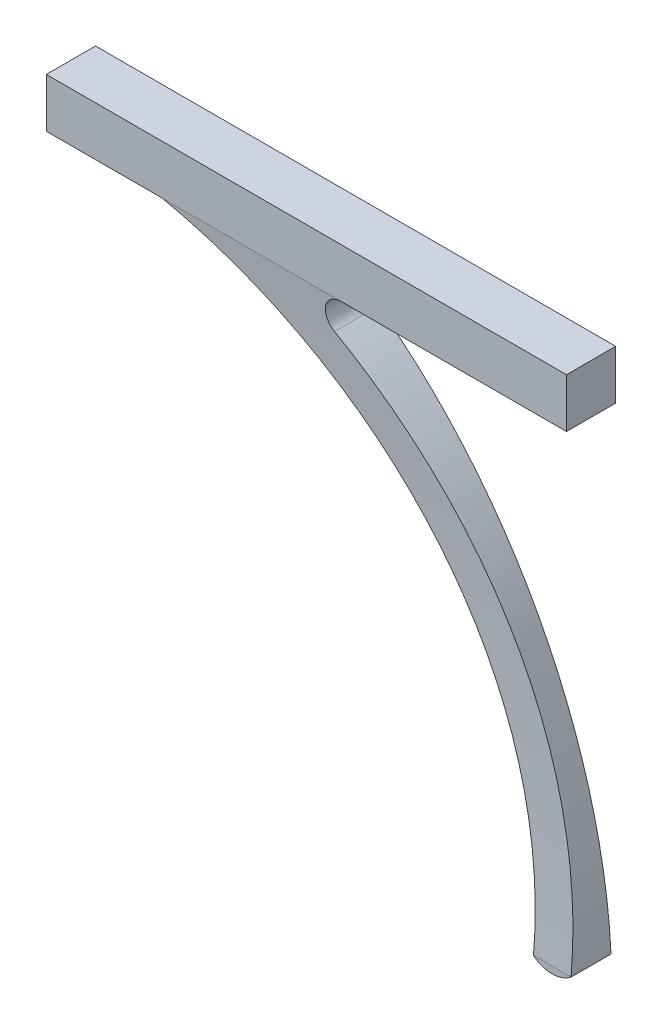
ISO-10303-21;
HEADER;
FILE_DESCRIPTION(('STEP AP214'),'2;1');
FILE_NAME('part.step','',(''),(''),'','','');
FILE_SCHEMA(('AUTOMOTIVE_DESIGN { 1 0 10303 214 1 1 1 1 }'));
ENDSEC;
DATA;
#1=APPLICATION_CONTEXT('core data for automotive mechanical design processes');
#2=APPLICATION_PROTOCOL_DEFINITION('international standard','automotive_design',2000,#1);
#3=PRODUCT_CONTEXT('',#1,'mechanical');
#4=PRODUCT('Part','Part','',(#3));
#5=PRODUCT_RELATED_PRODUCT_CATEGORY('part','',(#4));
#6=PRODUCT_DEFINITION_FORMATION('','',#4);
#7=PRODUCT_DEFINITION_CONTEXT('part definition',#1,'design');
#8=PRODUCT_DEFINITION('design','',#6,#7);
#9=PRODUCT_DEFINITION_SHAPE('','',#8);
#10=(LENGTH_UNIT() NAMED_UNIT(*) SI_UNIT(.MILLI.,.METRE.));
#11=(NAMED_UNIT(*) PLANE_ANGLE_UNIT() SI_UNIT($,.RADIAN.));
#12=(NAMED_UNIT(*) SI_UNIT($,.STERADIAN.) SOLID_ANGLE_UNIT());
#13=UNCERTAINTY_MEASURE_WITH_UNIT(LENGTH_MEASURE(1.E-05),#10,'distance_accuracy_value','');
#14=(GEOMETRIC_REPRESENTATION_CONTEXT(3) GLOBAL_UNCERTAINTY_ASSIGNED_CONTEXT((#13)) GLOBAL_UNIT_ASSIGNED_CONTEXT((#10,
#11,#12)) REPRESENTATION_CONTEXT('',''));
#15=CARTESIAN_POINT('',(0.,0.,0.));
#16=DIRECTION('',(0.,0.,1.));
#17=DIRECTION('',(1.,0.,0.));
#18=AXIS2_PLACEMENT_3D('',#15,#16,#17);
#19=CARTESIAN_POINT('',(-313.249254210473,43.7591889450389,8.5));
#20=DIRECTION('',(0.,0.,-1.));
#21=DIRECTION('',(-1.,0.,0.));
#22=AXIS2_PLACEMENT_3D('',#19,#20,#21);
#23=CYLINDRICAL_SURFACE('',#22,82.1861128246696);
#24=CARTESIAN_POINT('',(-294.419566448077,123.759188945039,8.5));
#25=CARTESIAN_POINT('',(-293.669472059671,123.582638201541,8.48435873597125));
#26=CARTESIAN_POINT('',(-292.921918514753,123.395551162552,8.46787217964508));
#27=CARTESIAN_POINT('',(-291.432403549191,123.00044038415,8.43329331302592));
#28=CARTESIAN_POINT('',(-290.690442120292,122.792416675651,8.4152010051039));
#29=CARTESIAN_POINT('',(-288.473957564391,122.137217220973,8.35864898485102));
#30=CARTESIAN_POINT('',(-287.008580838007,121.658853507064,8.31790884335726));
#31=CARTESIAN_POINT('',(-284.107290914414,120.620605151221,8.23116940272998));
#32=CARTESIAN_POINT('',(-282.671377060351,120.060722328958,8.18517022099383));
#33=CARTESIAN_POINT('',(-279.833890523642,118.861399545579,8.08885754144365));
#34=CARTESIAN_POINT('',(-278.432305863342,118.221987819824,8.03854557676907));
#35=CARTESIAN_POINT('',(-275.667384018503,116.865491304418,7.93462638026038));
#36=CARTESIAN_POINT('',(-274.304046647559,116.148406893397,7.88101916449015));
#37=CARTESIAN_POINT('',(-271.619877153803,114.638826224532,7.77162988161145));
#38=CARTESIAN_POINT('',(-270.299044889045,113.846330218559,7.71584782176724));
#39=CARTESIAN_POINT('',(-267.703580983387,112.188138206679,7.60328336951939));
#40=CARTESIAN_POINT('',(-266.428964879687,111.322417903903,7.54650065006936));
#41=CARTESIAN_POINT('',(-263.930371615023,109.520707074834,7.43320346787234));
#42=CARTESIAN_POINT('',(-262.706394983908,108.584715813571,7.37668900793766));
#43=CARTESIAN_POINT('',(-260.312927590535,106.64539474607,7.26521934278511));
#44=CARTESIAN_POINT('',(-259.143436887626,105.642064866485,7.21026413926572));
#45=CARTESIAN_POINT('',(-256.863088493362,103.571630309122,7.10324735337097));
#46=CARTESIAN_POINT('',(-255.752206636506,102.504552309023,7.05118457791752));
#47=CARTESIAN_POINT('',(-253.592052331464,100.309577454344,6.9512419366342));
#48=CARTESIAN_POINT('',(-252.542779716648,99.1816807642746,6.90336205949093));
#49=CARTESIAN_POINT('',(-250.509159467918,96.8685961632975,6.81308390821751));
#50=CARTESIAN_POINT('',(-249.524811646093,95.6834084182236,6.77068561822179));
#51=CARTESIAN_POINT('',(-247.623865138529,93.2590771622909,6.69262330716321));
#52=CARTESIAN_POINT('',(-246.70728775729,92.0199168773767,6.65696139833593));
#53=CARTESIAN_POINT('',(-244.945144362287,89.491887756503,6.59360217567692));
#54=CARTESIAN_POINT('',(-244.099578646608,88.2030187119141,6.56590489527714));
#55=CARTESIAN_POINT('',(-242.482176221134,85.5796660498312,6.51961863350087));
#56=CARTESIAN_POINT('',(-241.710339310347,84.2451825567001,6.50102962729374));
#57=CARTESIAN_POINT('',(-240.242581633349,81.5343076824797,6.47400972154924));
#58=CARTESIAN_POINT('',(-239.546691167879,80.1578998527316,6.46558286307791));
#59=CARTESIAN_POINT('',(-238.233421105707,77.3681005671482,6.45985128438425));
#60=CARTESIAN_POINT('',(-237.616042088396,75.9547088384755,6.46254664623571));
#61=CARTESIAN_POINT('',(-236.461766868341,73.0954408427164,6.47989128537772));
#62=CARTESIAN_POINT('',(-235.924871591969,71.6495642019466,6.49454070024771));
#63=CARTESIAN_POINT('',(-235.041619232833,69.049009711242,6.53190173981614));
#64=CARTESIAN_POINT('',(-234.679257730252,67.8997002025771,6.55215382514482));
#65=CARTESIAN_POINT('',(-234.005430623007,65.5863485068134,6.60064972628421));
#66=CARTESIAN_POINT('',(-233.693966980678,64.4223057535471,6.62889385010836));
#67=CARTESIAN_POINT('',(-233.122549533097,62.08183909679,6.69358515631587));
#68=CARTESIAN_POINT('',(-232.86259733815,60.9054148074489,6.73003259506801));
#69=CARTESIAN_POINT('',(-232.394689026862,58.5425242262865,6.81128039771391));
#70=CARTESIAN_POINT('',(-232.186734225292,57.3560576813274,6.85608097276957));
#71=CARTESIAN_POINT('',(-231.822989063393,54.9740769609485,6.95417892508099));
#72=CARTESIAN_POINT('',(-231.667260221657,53.7785537999688,7.00748621438765));
#73=CARTESIAN_POINT('',(-231.408561812056,51.3822201546187,7.12258129061355));
#74=CARTESIAN_POINT('',(-231.30559221254,50.1814096734205,7.18436907244527));
#75=CARTESIAN_POINT('',(-231.152564850473,47.7768768024428,7.3163865346883));
#76=CARTESIAN_POINT('',(-231.102507497005,46.5731543902221,7.38661628036287));
#77=CARTESIAN_POINT('',(-231.055316714652,44.1651735861885,7.53539620413931));
#78=CARTESIAN_POINT('',(-231.058183839401,42.9609151889006,7.613946469272));
#79=CARTESIAN_POINT('',(-231.087519066023,41.7575847677363,7.696595714388));
#80=B_SPLINE_CURVE_WITH_KNOTS('',3,(#24,#25,#26,#27,#28,#29,#30,#31,#32,#33,#34,#35,#36,#37,#38,
#39,#40,#41,#42,#43,#44,#45,#46,#47,#48,#49,#50,#51,#52,#53,#54,#55,#56,#57,#58,#59,#60,#61,#62,
#63,#64,#65,#66,#67,#68,#69,#70,#71,#72,#73,#74,#75,#76,#77,#78,#79),.UNSPECIFIED.,.F.,.F.,(4,2,
2,2,2,2,2,2,2,2,2,2,2,2,2,2,2,2,2,2,2,2,2,2,2,2,2,4),(0.,2.3120909415322,4.6241784692045,
9.24757371754982,13.8708657781513,18.4925210794231,23.114153852576,27.7357711901994,
32.3589281082134,36.9821333868858,41.6053437013353,46.2266326401015,50.8479090793675,
55.4691721427836,60.0918818363051,64.7146109336143,69.3373274285461,73.9618815811893,
78.5864698596959,83.2111113634305,86.8257322023863,90.4404923679263,94.0553655171056,
97.6703300603446,101.289537948483,104.908743665439,108.527977363603,112.147248921902),.UNSPECIFIED.);
#81=CARTESIAN_POINT('',(-294.419566448077,123.759188945039,8.5));
#82=VERTEX_POINT('',#81);
#83=CARTESIAN_POINT('',(-231.087519066023,41.7575847677363,7.69659571438802));
#84=VERTEX_POINT('',#83);
#85=EDGE_CURVE('E121',#82,#84,#80,.T.);
#86=ORIENTED_EDGE('',*,*,#85,.F.);
#87=DIRECTION('',(0.,0.,-1.));
#88=VECTOR('',#87,1.);
#89=CARTESIAN_POINT('',(-294.419566448077,123.759188945039,8.5));
#90=LINE('',#89,#88);
#91=CARTESIAN_POINT('',(-294.419566448078,123.759188945039,0.));
#92=VERTEX_POINT('',#91);
#93=EDGE_CURVE('E144',#82,#92,#90,.T.);
#94=ORIENTED_EDGE('',*,*,#93,.T.);
#95=CARTESIAN_POINT('',(-231.087519066023,41.7575847677363,0.803404285611979));
#96=CARTESIAN_POINT('',(-231.059474425246,42.908076433553,0.88242293741362));
#97=CARTESIAN_POINT('',(-231.055621302527,44.0594159173543,0.957696484557822));
#98=CARTESIAN_POINT('',(-231.096291119569,46.3615382006074,1.1006328602991));
#99=CARTESIAN_POINT('',(-231.140806762132,47.5123210578344,1.16829683522215));
#100=CARTESIAN_POINT('',(-231.278193470379,49.811338956632,1.29591262447544));
#101=CARTESIAN_POINT('',(-231.371060869591,50.959574184758,1.35586502313801));
#102=CARTESIAN_POINT('',(-231.605138079606,53.2526010893823,1.46807698343186));
#103=CARTESIAN_POINT('',(-231.74639429284,54.3973883925545,1.52032909183136));
#104=CARTESIAN_POINT('',(-232.077032390484,56.680411107077,1.61708514766746));
#105=CARTESIAN_POINT('',(-232.266417664698,57.8186460511576,1.6615885489787));
#106=CARTESIAN_POINT('',(-232.693023518721,60.0865434685713,1.74291399707813));
#107=CARTESIAN_POINT('',(-232.9302512746,61.2162046294839,1.77973488985078));
#108=CARTESIAN_POINT('',(-233.535899728585,63.8256344052919,1.85640719435917));
#109=CARTESIAN_POINT('',(-233.921991171036,65.3014215830802,1.89343929075358));
#110=CARTESIAN_POINT('',(-234.775833146094,68.2297008616265,1.95470108200961));
#111=CARTESIAN_POINT('',(-235.243598842123,69.6821885818987,1.97892839620036));
#112=CARTESIAN_POINT('',(-236.259320205417,72.5590898134076,2.01513510866622));
#113=CARTESIAN_POINT('',(-236.807279494838,73.9835020532417,2.02711395351151));
#114=CARTESIAN_POINT('',(-237.981753969136,76.7999038797588,2.03952312737867));
#115=CARTESIAN_POINT('',(-238.608282806899,78.1918877814598,2.03995144648564));
#116=CARTESIAN_POINT('',(-239.937809199529,80.9387170117211,2.03008400000596));
#117=CARTESIAN_POINT('',(-240.640803386938,82.2935639724684,2.01978870650555));
#118=CARTESIAN_POINT('',(-242.121077867518,84.9619481508134,1.98941605570342));
#119=CARTESIAN_POINT('',(-242.898356910003,86.2754860634102,1.9693388630699));
#120=CARTESIAN_POINT('',(-244.321589163354,88.5346766417507,1.92655202438139));
#121=CARTESIAN_POINT('',(-244.95186220458,89.4902811624843,1.90575195097845));
#122=CARTESIAN_POINT('',(-246.251721674659,91.3742908557583,1.8597048168969));
#123=CARTESIAN_POINT('',(-246.921310581357,92.3026943084382,1.83445747573252));
#124=CARTESIAN_POINT('',(-248.987212568114,95.0444921795137,1.75277848381223));
#125=CARTESIAN_POINT('',(-250.440946386911,96.8149271153089,1.69040086472941));
#126=CARTESIAN_POINT('',(-253.491472117216,100.228708904158,1.55390868086331));
#127=CARTESIAN_POINT('',(-255.08832113437,101.872004534555,1.47978942180974));
#128=CARTESIAN_POINT('',(-257.581709987151,104.232263669392,1.36306704804531));
#129=CARTESIAN_POINT('',(-258.429291482623,105.00164875368,1.32323095610907));
#130=CARTESIAN_POINT('',(-260.155785958075,106.504309074987,1.2422457048307));
#131=CARTESIAN_POINT('',(-261.034697019043,107.237586517159,1.20109662592835));
#132=CARTESIAN_POINT('',(-263.13024246653,108.912919790037,1.10371321650296));
#133=CARTESIAN_POINT('',(-264.358947676044,109.839912437794,1.04716388986023));
#134=CARTESIAN_POINT('',(-266.866472072212,111.623480811946,0.933942273887007));
#135=CARTESIAN_POINT('',(-268.145293425377,112.48005348913,0.877269979340892));
#136=CARTESIAN_POINT('',(-270.749215121019,114.120198744532,0.765037132447914));
#137=CARTESIAN_POINT('',(-272.07432151041,114.903761734977,0.709476726866621));
#138=CARTESIAN_POINT('',(-274.76461650495,116.394244101905,0.600736141236316));
#139=CARTESIAN_POINT('',(-276.129746034915,117.101269860362,0.547552719344406));
#140=CARTESIAN_POINT('',(-278.897387660655,118.43761728361,0.444595335963638));
#141=CARTESIAN_POINT('',(-280.299894552288,119.06694969782,0.394820903242492));
#142=CARTESIAN_POINT('',(-283.137475397781,120.245767285385,0.299710568402292));
#143=CARTESIAN_POINT('',(-284.572532167996,120.795293505427,0.254372388529911));
#144=CARTESIAN_POINT('',(-286.71060191115,121.546015182757,0.191414944744235));
#145=CARTESIAN_POINT('',(-287.402649518151,121.778694653327,0.171733191315946));
#146=CARTESIAN_POINT('',(-288.792605565693,122.225501343955,0.133661662247231));
#147=CARTESIAN_POINT('',(-289.490512742467,122.439632457143,0.115271615643389));
#148=CARTESIAN_POINT('',(-290.890684224265,122.848901516117,0.0798913684598071));
#149=CARTESIAN_POINT('',(-291.592939713677,123.04406946255,0.0628989635036625));
#150=CARTESIAN_POINT('',(-293.002571162949,123.415704425479,0.0303516093660585));
#151=CARTESIAN_POINT('',(-293.709948158489,123.592167539835,0.0147969602108453));
#152=CARTESIAN_POINT('',(-294.419566448077,123.759188945039,0.));
#153=B_SPLINE_CURVE_WITH_KNOTS('',3,(#95,#96,#97,#98,#99,#100,#101,#102,#103,#104,#105,#106,
#107,#108,#109,#110,#111,#112,#113,#114,#115,#116,#117,#118,#119,#120,#121,#122,#123,#124,#125,
#126,#127,#128,#129,#130,#131,#132,#133,#134,#135,#136,#137,#138,#139,#140,#141,#142,#143,#144,
#145,#146,#147,#148,#149,#150,#151,#152),.UNSPECIFIED.,.F.,.F.,(4,2,2,2,2,2,2,2,2,2,2,2,2,2,2,2,
2,2,2,2,2,2,2,2,2,2,2,2,4),(0.,3.46037116651907,6.92022035338118,10.3798072210818,
13.8427209884474,17.3058787216971,20.7695562936249,25.344746626642,29.9207872821484,
34.4970346904666,39.0740784095984,43.650920641777,48.2276858301887,51.6614757544057,
55.0954823227079,61.9618940106603,68.831057828583,72.2664008896459,75.7015338879152,
80.3196272744011,84.9379205208813,89.556819398313,94.1692135537212,98.7809688352001,
103.390343689595,105.581279993134,107.771755319296,109.958706768987,112.1461135592),.UNSPECIFIED.);
#154=CARTESIAN_POINT('',(-231.087519066023,41.7575847677363,0.803404285611979));
#155=VERTEX_POINT('',#154);
#156=EDGE_CURVE('E199',#155,#92,#153,.T.);
#157=ORIENTED_EDGE('',*,*,#156,.F.);
#158=CARTESIAN_POINT('',(-313.249254210473,43.7591889450389,0.803404285611979));
#159=DIRECTION('',(0.,0.,-1.));
#160=DIRECTION('',(0.,1.,0.));
#161=AXIS2_PLACEMENT_3D('',#158,#159,#160);
#162=CIRCLE('',#161,82.1861128246696);
#163=CARTESIAN_POINT('',(-231.088431445672,41.7204776265152,0.80340428561198));
#164=VERTEX_POINT('',#163);
#165=EDGE_CURVE('E272',#164,#155,#162,.F.);
#166=ORIENTED_EDGE('',*,*,#165,.F.);
#167=DIRECTION('',(0.,0.,-1.));
#168=VECTOR('',#167,1.);
#169=CARTESIAN_POINT('',(-231.088431445672,41.7204776265151,8.5));
#170=LINE('',#169,#168);
#171=CARTESIAN_POINT('',(-231.088431445672,41.7204776265152,7.69659571438802));
#172=VERTEX_POINT('',#171);
#173=EDGE_CURVE('E141',#172,#164,#170,.T.);
#174=ORIENTED_EDGE('',*,*,#173,.F.);
#175=CARTESIAN_POINT('',(-313.249254210473,43.7591889450389,7.69659571438802));
#176=DIRECTION('',(0.,0.,1.));
#177=DIRECTION('',(0.,-1.,0.));
#178=AXIS2_PLACEMENT_3D('',#175,#176,#177);
#179=CIRCLE('',#178,82.1861128246696);
#180=EDGE_CURVE('E117',#84,#172,#179,.F.);
#181=ORIENTED_EDGE('',*,*,#180,.F.);
#182=EDGE_LOOP('',(#86,#94,#157,#166,#174,#181));
#183=FACE_BOUND('',#182,.T.);
#184=ADVANCED_FACE('F33',(#183),#23,.F.);
#185=CARTESIAN_POINT('',(-227.860247430491,45.7986261947213,8.5));
#186=DIRECTION('',(0.,0.,-1.));
#187=DIRECTION('',(-1.,0.,0.));
#188=AXIS2_PLACEMENT_3D('',#185,#186,#187);
#189=CYLINDRICAL_SURFACE('',#188,5.20119868686344);
#190=CARTESIAN_POINT('',(-227.860247430491,45.7986261947213,7.69659571438802));
#191=DIRECTION('',(0.,0.,1.));
#192=DIRECTION('',(0.,-1.,0.));
#193=AXIS2_PLACEMENT_3D('',#190,#191,#192);
#194=CIRCLE('',#193,5.20119868686344);
#195=CARTESIAN_POINT('',(-224.585731899055,41.7575847677363,7.69659571438802));
#196=VERTEX_POINT('',#195);
#197=EDGE_CURVE('E112',#172,#196,#194,.T.);
#198=ORIENTED_EDGE('',*,*,#197,.F.);
#199=ORIENTED_EDGE('',*,*,#173,.T.);
#200=CARTESIAN_POINT('',(-227.860247430491,45.7986261947213,0.80340428561198));
#201=DIRECTION('',(0.,0.,-1.));
#202=DIRECTION('',(0.,1.,0.));
#203=AXIS2_PLACEMENT_3D('',#200,#201,#202);
#204=CIRCLE('',#203,5.20119868686344);
#205=CARTESIAN_POINT('',(-224.585731899055,41.7575847677363,0.803404285611979));
#206=VERTEX_POINT('',#205);
#207=EDGE_CURVE('E140',#206,#164,#204,.T.);
#208=ORIENTED_EDGE('',*,*,#207,.F.);
#209=DIRECTION('',(0.,0.,-1.));
#210=VECTOR('',#209,1.);
#211=CARTESIAN_POINT('',(-224.585731899055,41.7575847677363,8.5));
#212=LINE('',#211,#210);
#213=EDGE_CURVE('E132',#196,#206,#212,.T.);
#214=ORIENTED_EDGE('',*,*,#213,.F.);
#215=EDGE_LOOP('',(#198,#199,#208,#214));
#216=FACE_BOUND('',#215,.T.);
#217=ADVANCED_FACE('F138',(#216),#189,.T.);
#218=CARTESIAN_POINT('',(-313.249254210473,43.7591889450389,8.5));
#219=DIRECTION('',(0.,0.,-1.));
#220=DIRECTION('',(-1.,0.,0.));
#221=AXIS2_PLACEMENT_3D('',#218,#219,#220);
#222=CYLINDRICAL_SURFACE('',#221,88.6861128246696);
#223=CARTESIAN_POINT('',(-224.585731899055,41.7575847677363,7.696595714388));
#224=CARTESIAN_POINT('',(-224.55972656261,42.9089268251765,7.61751999584518));
#225=CARTESIAN_POINT('',(-224.556168015029,44.0610345935058,7.54219799927536));
#226=CARTESIAN_POINT('',(-224.593945508913,46.3647922657207,7.39917011182945));
#227=CARTESIAN_POINT('',(-224.635274009766,47.5164422140078,7.3314629438406));
#228=CARTESIAN_POINT('',(-224.76281247781,49.8175855682186,7.20375215052553));
#229=CARTESIAN_POINT('',(-224.849018646739,50.9670791483866,7.14374787379385));
#230=CARTESIAN_POINT('',(-225.066328567873,53.2633785498167,7.03141562379806));
#231=CARTESIAN_POINT('',(-225.197478155021,54.4101804190939,6.97909556530504));
#232=CARTESIAN_POINT('',(-225.504506972606,56.6982129390336,6.88219405552576));
#233=CARTESIAN_POINT('',(-225.680389848693,57.8394431278883,6.83761323546651));
#234=CARTESIAN_POINT('',(-226.076661309992,60.1145971626281,6.75613361618431));
#235=CARTESIAN_POINT('',(-226.297057474786,61.2485197302167,6.71923612743089));
#236=CARTESIAN_POINT('',(-226.884172189299,63.9827682079564,6.63909189596482));
#237=CARTESIAN_POINT('',(-227.273425509187,65.5784261204042,6.59971420515758));
#238=CARTESIAN_POINT('',(-228.14008335929,68.7462479296111,6.53584535357591));
#239=CARTESIAN_POINT('',(-228.617507793213,70.3184064348331,6.51135755940853));
#240=CARTESIAN_POINT('',(-229.659015162304,73.4340362013088,6.47665352536309));
#241=CARTESIAN_POINT('',(-230.223103484624,74.9775056725202,6.46643817307939));
#242=CARTESIAN_POINT('',(-231.436558005383,78.0317950664929,6.45949110097085));
#243=CARTESIAN_POINT('',(-232.085982160557,79.5425919798477,6.46276859125319));
#244=CARTESIAN_POINT('',(-233.467717195027,82.525600576164,6.48188465939706));
#245=CARTESIAN_POINT('',(-234.200023060619,83.9978145864644,6.49772247780373));
#246=CARTESIAN_POINT('',(-235.745201064392,86.8990713735047,6.54087925136754));
#247=CARTESIAN_POINT('',(-236.558069403155,88.3281161820089,6.56819766528367));
#248=CARTESIAN_POINT('',(-238.26288369926,91.1403875833293,6.63315933276149));
#249=CARTESIAN_POINT('',(-239.154925511324,92.5235557735506,6.67081522046402));
#250=CARTESIAN_POINT('',(-241.014469640606,95.2380116194072,6.75513888085665));
#251=CARTESIAN_POINT('',(-241.981975631633,96.5692967444916,6.80180709245548));
#252=CARTESIAN_POINT('',(-243.989501989992,99.1759726586165,6.90277931672509));
#253=CARTESIAN_POINT('',(-245.02953118128,100.451356615265,6.95708425938311));
#254=CARTESIAN_POINT('',(-247.177471192168,102.940650023421,7.07181505414447));
#255=CARTESIAN_POINT('',(-248.285298629001,104.154631762254,7.13223344501574));
#256=CARTESIAN_POINT('',(-250.566372055288,106.518897248798,7.25776009733131));
#257=CARTESIAN_POINT('',(-251.739609542855,107.669189236234,7.32286774959313));
#258=CARTESIAN_POINT('',(-254.147551953857,109.902290984823,7.45625845632982));
#259=CARTESIAN_POINT('',(-255.38222754637,110.985132401705,7.52453999456601));
#260=CARTESIAN_POINT('',(-257.320028612649,112.591707454237,7.63055268365731));
#261=CARTESIAN_POINT('',(-258.002457992304,113.140635323751,7.66767753970283));
#262=CARTESIAN_POINT('',(-259.383135367613,114.217930633882,7.74218286374745));
#263=CARTESIAN_POINT('',(-260.081379876659,114.74630253779,7.77956327416242));
#264=CARTESIAN_POINT('',(-261.491946550947,115.781210088159,7.85429802848784));
#265=CARTESIAN_POINT('',(-262.20424144664,116.287782927862,7.89165230036703));
#266=CARTESIAN_POINT('',(-263.643653191621,117.279766055621,7.96619344005791));
#267=CARTESIAN_POINT('',(-264.3707731993,117.765171763542,8.00338027009294));
#268=CARTESIAN_POINT('',(-265.104923374475,118.239723424216,8.04037138428276));
#269=B_SPLINE_CURVE_WITH_KNOTS('',3,(#223,#224,#225,#226,#227,#228,#229,#230,#231,#232,#233,
#234,#235,#236,#237,#238,#239,#240,#241,#242,#243,#244,#245,#246,#247,#248,#249,#250,#251,#252,
#253,#254,#255,#256,#257,#258,#259,#260,#261,#262,#263,#264,#265,#266,#267,#268),.UNSPECIFIED.,
.F.,.F.,(4,2,2,2,2,2,2,2,2,2,2,2,2,2,2,2,2,2,2,2,2,2,4),(0.,3.4628192940658,6.92505695633947,
10.3870016366328,13.8524874941219,17.3182558705647,20.7846148854068,25.7106391487169,
30.637776772833,35.5652207989592,40.4960288167269,45.4265387180305,50.3568162015199,
55.2931463515447,60.2297169661838,65.1668892688617,70.0981070004328,75.0286852684533,
79.9569318193064,82.5863790074835,85.2152520436365,87.839445844054,90.464204677158),.UNSPECIFIED.);
#270=CARTESIAN_POINT('',(-265.104923374475,118.239723424216,8.04037138428276));
#271=VERTEX_POINT('',#270);
#272=EDGE_CURVE('E125',#196,#271,#269,.T.);
#273=ORIENTED_EDGE('',*,*,#272,.F.);
#274=ORIENTED_EDGE('',*,*,#213,.T.);
#275=CARTESIAN_POINT('',(-265.104923374475,118.239723424216,0.45962861571724));
#276=CARTESIAN_POINT('',(-264.05875741983,117.563499098451,0.512338938695355));
#277=CARTESIAN_POINT('',(-263.026871471605,116.865216917638,0.565449681420208));
#278=CARTESIAN_POINT('',(-260.993447995448,115.425835260655,0.671839498424452));
#279=CARTESIAN_POINT('',(-259.991909849686,114.684736657051,0.725118569252544));
#280=CARTESIAN_POINT('',(-258.020939574522,113.161002156828,0.831214089938429));
#281=CARTESIAN_POINT('',(-257.0515070557,112.378366764322,0.884030545401705));
#282=CARTESIAN_POINT('',(-255.14643804741,110.772926220234,0.988554805988382));
#283=CARTESIAN_POINT('',(-254.210801447191,109.95012120031,1.04026261474459));
#284=CARTESIAN_POINT('',(-252.376110709956,108.266824071479,1.14185513136758));
#285=CARTESIAN_POINT('',(-251.477012520414,107.406380109203,1.1917420267501));
#286=CARTESIAN_POINT('',(-249.715763804523,105.648366756895,1.28910938569034));
#287=CARTESIAN_POINT('',(-248.853612767618,104.750797880211,1.33658988250256));
#288=CARTESIAN_POINT('',(-247.16777761278,102.920100165014,1.42849857740976));
#289=CARTESIAN_POINT('',(-246.344093104053,101.986971687938,1.47292680651586));
#290=CARTESIAN_POINT('',(-244.736644866626,100.086780925802,1.55809437647361));
#291=CARTESIAN_POINT('',(-243.952881063531,99.1197187039843,1.59883372419987));
#292=CARTESIAN_POINT('',(-242.425897023734,97.1523607534362,1.67603983918017));
#293=CARTESIAN_POINT('',(-241.68271862334,96.1520323801859,1.71250224049479));
#294=CARTESIAN_POINT('',(-240.23908377708,94.1208223372039,1.78050178137695));
#295=CARTESIAN_POINT('',(-239.538627994048,93.0899401938037,1.81203884454045));
#296=CARTESIAN_POINT('',(-238.181709711828,90.9994600087555,1.86960612562396));
#297=CARTESIAN_POINT('',(-237.525247427786,89.9398618267096,1.89563631661438));
#298=CARTESIAN_POINT('',(-236.257506547547,87.7938405703901,1.94163799721718));
#299=CARTESIAN_POINT('',(-235.646228014995,86.7074174583335,1.96160947829533));
#300=CARTESIAN_POINT('',(-234.470066311548,84.5098824485737,1.99497332245867));
#301=CARTESIAN_POINT('',(-233.90517515682,83.3987748413738,2.00836681967955));
#302=CARTESIAN_POINT('',(-232.822696624088,81.1536870598558,2.02810149283147));
#303=CARTESIAN_POINT('',(-232.305109313609,80.0197068528905,2.0344426586956));
#304=CARTESIAN_POINT('',(-231.318181389729,77.7309277661429,2.03963751426573));
#305=CARTESIAN_POINT('',(-230.848840635876,76.5761289469778,2.03849122576926));
#306=CARTESIAN_POINT('',(-229.959256579719,74.2478100448063,2.02832364627047));
#307=CARTESIAN_POINT('',(-229.53901321732,73.0742899847163,2.01930236490711));
#308=CARTESIAN_POINT('',(-228.739004660193,70.6826322084997,1.99273681148453));
#309=CARTESIAN_POINT('',(-228.360435632129,69.4640963521296,1.97499550615527));
#310=CARTESIAN_POINT('',(-227.656245670744,67.0119474778712,1.93060485803941));
#311=CARTESIAN_POINT('',(-227.330626133021,65.778334063502,1.90395528051241));
#312=CARTESIAN_POINT('',(-226.732939686817,63.2984004104571,1.84150917370338));
#313=CARTESIAN_POINT('',(-226.460873986155,62.0520798858596,1.80571243816378));
#314=CARTESIAN_POINT('',(-225.970788378397,59.5491314512916,1.72479929004103));
#315=CARTESIAN_POINT('',(-225.752769580605,58.2925033303059,1.67968268620389));
#316=CARTESIAN_POINT('',(-225.370707018068,55.7683811151531,1.57990723220108));
#317=CARTESIAN_POINT('',(-225.206792913623,54.5008682811421,1.52522593302004));
#318=CARTESIAN_POINT('',(-224.933914205964,51.9603803510123,1.40636096066288));
#319=CARTESIAN_POINT('',(-224.824949824141,50.6874052329069,1.34217724920307));
#320=CARTESIAN_POINT('',(-224.662124263162,48.1384280268944,1.20433895132301));
#321=CARTESIAN_POINT('',(-224.608263965592,46.8624258908867,1.13068421340115));
#322=CARTESIAN_POINT('',(-224.555657856678,44.3098304483505,0.974025450180995));
#323=CARTESIAN_POINT('',(-224.556913285601,43.0332371291651,0.891021214533159));
#324=CARTESIAN_POINT('',(-224.585731899055,41.7575847677363,0.803404285611979));
#325=B_SPLINE_CURVE_WITH_KNOTS('',3,(#275,#276,#277,#278,#279,#280,#281,#282,#283,#284,#285,
#286,#287,#288,#289,#290,#291,#292,#293,#294,#295,#296,#297,#298,#299,#300,#301,#302,#303,#304,
#305,#306,#307,#308,#309,#310,#311,#312,#313,#314,#315,#316,#317,#318,#319,#320,#321,#322,#323,
#324),.UNSPECIFIED.,.F.,.F.,(4,2,2,2,2,2,2,2,2,2,2,2,2,2,2,2,2,2,2,2,2,2,2,2,4),(0.,
3.7401344266666,7.48019265917141,11.2202055107412,14.9602061051836,18.6955550263194,
22.4308523138299,26.1661116449949,29.9013640149697,33.6403967734173,37.3794875276425,
41.1185965662708,44.8577108717408,48.5961802755034,52.3346550157717,56.0731188725669,
59.8115781535049,63.6386876651337,67.4658980322411,71.2931947060218,75.1205699279656,
78.9570518522755,82.7935492335737,86.6301079923658,90.4667530851689),.UNSPECIFIED.);
#326=CARTESIAN_POINT('',(-265.104923374475,118.239723424216,0.45962861571724));
#327=VERTEX_POINT('',#326);
#328=EDGE_CURVE('E193',#327,#206,#325,.T.);
#329=ORIENTED_EDGE('',*,*,#328,.F.);
#330=DIRECTION('',(0.,0.,-1.));
#331=VECTOR('',#330,1.);
#332=CARTESIAN_POINT('',(-265.104923374475,118.239723424216,8.5));
#333=LINE('',#332,#331);
#334=EDGE_CURVE('E135',#327,#271,#333,.F.);
#335=ORIENTED_EDGE('',*,*,#334,.T.);
#336=EDGE_LOOP('',(#273,#274,#329,#335));
#337=FACE_BOUND('',#336,.T.);
#338=ADVANCED_FACE('F130',(#337),#222,.T.);
#339=CARTESIAN_POINT('',(-263.476337027551,120.759188945039,8.5));
#340=DIRECTION('',(0.,0.,-1.));
#341=DIRECTION('',(-1.,0.,0.));
#342=AXIS2_PLACEMENT_3D('',#339,#340,#341);
#343=CYLINDRICAL_SURFACE('',#342,3.);
#344=CARTESIAN_POINT('',(-265.104923374475,118.239723424216,8.04037138428276));
#345=CARTESIAN_POINT('',(-265.175863237226,118.285569324873,8.04394512792844));
#346=CARTESIAN_POINT('',(-265.244845612845,118.334416832292,8.04775888264039));
#347=CARTESIAN_POINT('',(-265.378429472576,118.437732230833,8.05584153836399));
#348=CARTESIAN_POINT('',(-265.443031234296,118.492199765249,8.06011041048969));
#349=CARTESIAN_POINT('',(-265.567345982876,118.606331401964,8.06907520105967));
#350=CARTESIAN_POINT('',(-265.627062942236,118.665991198557,8.07377076580726));
#351=CARTESIAN_POINT('',(-265.741234839262,118.790088437241,8.0835610770332));
#352=CARTESIAN_POINT('',(-265.795689819674,118.854525840513,8.08865582026818));
#353=CARTESIAN_POINT('',(-265.950611846465,119.054396015304,8.10449861336457));
#354=CARTESIAN_POINT('',(-266.042698186111,119.19644398208,8.11580971187725));
#355=CARTESIAN_POINT('',(-266.201633835773,119.493797427906,8.13962254360507));
#356=CARTESIAN_POINT('',(-266.268487042861,119.6491008552,8.15212409259008));
#357=CARTESIAN_POINT('',(-266.375325429607,119.969028742402,8.17803098019826));
#358=CARTESIAN_POINT('',(-266.41525048105,120.133673177806,8.19143826835896));
#359=CARTESIAN_POINT('',(-266.466873937938,120.467307096569,8.21877134310208));
#360=CARTESIAN_POINT('',(-266.478567791448,120.636297276188,8.23269721293194));
#361=CARTESIAN_POINT('',(-266.473398866583,120.974213110573,8.26071000672259));
#362=CARTESIAN_POINT('',(-266.456471691428,121.143137762187,8.2747972228482));
#363=CARTESIAN_POINT('',(-266.394414507182,121.475737065725,8.30269289519272));
#364=CARTESIAN_POINT('',(-266.349286300702,121.639412052505,8.31650136917061));
#365=CARTESIAN_POINT('',(-266.232063329199,121.956948339665,8.34343306789433));
#366=CARTESIAN_POINT('',(-266.159956515417,122.110805219246,8.35655598347821));
#367=CARTESIAN_POINT('',(-265.990793946666,122.404237761754,8.38170340751592));
#368=CARTESIAN_POINT('',(-265.893737662357,122.543813121589,8.39372789265763));
#369=CARTESIAN_POINT('',(-265.677615892484,122.804421133484,8.41627177416927));
#370=CARTESIAN_POINT('',(-265.558592703243,122.92548861622,8.42679399517702));
#371=CARTESIAN_POINT('',(-265.301757393548,123.14591771135,8.44601594709561));
#372=CARTESIAN_POINT('',(-265.16394424256,123.245278132444,8.45471557798024));
#373=CARTESIAN_POINT('',(-264.873936569159,123.419117583666,8.46997431601782));
#374=CARTESIAN_POINT('',(-264.72178893873,123.493674359239,8.47654011002195));
#375=CARTESIAN_POINT('',(-264.407089269478,123.616137653008,8.48734189460664));
#376=CARTESIAN_POINT('',(-264.244544395026,123.664062306488,8.49157947057724));
#377=CARTESIAN_POINT('',(-263.980030019565,123.718340348545,8.49638207906104));
#378=CARTESIAN_POINT('',(-263.879827140568,123.73365381304,8.49773807436236));
#379=CARTESIAN_POINT('',(-263.678543330677,123.754073444014,8.49954676242769));
#380=CARTESIAN_POINT('',(-263.577464091013,123.759196155209,8.50000091932648));
#381=CARTESIAN_POINT('',(-263.476337027551,123.759188945039,8.5));
#382=B_SPLINE_CURVE_WITH_KNOTS('',3,(#344,#345,#346,#347,#348,#349,#350,#351,#352,#353,#354,
#355,#356,#357,#358,#359,#360,#361,#362,#363,#364,#365,#366,#367,#368,#369,#370,#371,#372,#373,
#374,#375,#376,#377,#378,#379,#380,#381),.UNSPECIFIED.,.F.,.F.,(4,2,2,2,2,2,2,2,2,2,2,2,2,2,2,2,
2,2,4),(0.,0.253537709936742,0.507059337602596,0.760372698875559,1.01368400216497,
1.52005586216726,2.02634948471561,2.53376990669925,3.04127213856049,3.54991776107001,
4.05853087424737,4.5673714078314,5.07622273808971,5.58410432966319,6.09201378716609,
6.59831589640245,7.10427281274747,7.4079228058084,7.71107941869953),.UNSPECIFIED.);
#383=CARTESIAN_POINT('',(-263.476337027551,123.759188945039,8.5));
#384=VERTEX_POINT('',#383);
#385=EDGE_CURVE('E49',#271,#384,#382,.T.);
#386=ORIENTED_EDGE('',*,*,#385,.F.);
#387=ORIENTED_EDGE('',*,*,#334,.F.);
#388=CARTESIAN_POINT('',(-263.476337027551,123.759188945039,0.));
#389=CARTESIAN_POINT('',(-263.560479978099,123.759197205696,-8.8432952959168E-07));
#390=CARTESIAN_POINT('',(-263.644618984148,123.755648966715,0.000313634265869425));
#391=CARTESIAN_POINT('',(-263.812293096945,123.741503380939,0.00156671070884829));
#392=CARTESIAN_POINT('',(-263.895828237319,123.73090642976,0.00250523353358571));
#393=CARTESIAN_POINT('',(-264.061640519223,123.702738792644,0.0049985357588725));
#394=CARTESIAN_POINT('',(-264.143918631486,123.685173803266,0.0065528117632542));
#395=CARTESIAN_POINT('',(-264.30667645665,123.643215496317,0.0102625754992182));
#396=CARTESIAN_POINT('',(-264.387156188527,123.618822250839,0.0124180568832194));
#397=CARTESIAN_POINT('',(-264.625113098258,123.535605850471,0.0197640221254074));
#398=CARTESIAN_POINT('',(-264.779185087996,123.466732857753,0.0258351979316263));
#399=CARTESIAN_POINT('',(-265.073449942144,123.304284971428,0.0401106740228014));
#400=CARTESIAN_POINT('',(-265.213645098382,123.210714166181,0.0483146212554739));
#401=CARTESIAN_POINT('',(-265.476609583876,123.00132871857,0.0666020009737796));
#402=CARTESIAN_POINT('',(-265.59934695022,122.885474166763,0.076688804620837));
#403=CARTESIAN_POINT('',(-265.823655469488,122.634923752752,0.0984042185134021));
#404=CARTESIAN_POINT('',(-265.92522302658,122.50022469617,0.110033090141283));
#405=CARTESIAN_POINT('',(-266.104681466997,122.215297454237,0.134506851141259));
#406=CARTESIAN_POINT('',(-266.182485735718,122.065015072585,0.147355970355305));
#407=CARTESIAN_POINT('',(-266.311752007278,121.753595825886,0.173835643760001));
#408=CARTESIAN_POINT('',(-266.363215409609,121.592459538023,0.187466156392374));
#409=CARTESIAN_POINT('',(-266.438498089449,121.263355398283,0.215144059113246));
#410=CARTESIAN_POINT('',(-266.462230867641,121.095367852864,0.229192614191383));
#411=CARTESIAN_POINT('',(-266.481096346933,120.757785667971,0.257256876401641));
#412=CARTESIAN_POINT('',(-266.476227949831,120.588190967036,0.271272582251775));
#413=CARTESIAN_POINT('',(-266.437996571074,120.252015792945,0.298891494139811));
#414=CARTESIAN_POINT('',(-266.404601737119,120.085438901846,0.312494221461903));
#415=CARTESIAN_POINT('',(-266.310191079814,119.760220430319,0.338900971753188));
#416=CARTESIAN_POINT('',(-266.249173395002,119.601579385476,0.351704940829063));
#417=CARTESIAN_POINT('',(-266.101297836386,119.296915751358,0.376164400477053));
#418=CARTESIAN_POINT('',(-266.014460662314,119.150883174318,0.387820801138538));
#419=CARTESIAN_POINT('',(-265.817364354093,118.875520209568,0.409696304161782));
#420=CARTESIAN_POINT('',(-265.707120757954,118.746178832784,0.419916352581421));
#421=CARTESIAN_POINT('',(-265.513411946524,118.55441553383,0.435007776893447));
#422=CARTESIAN_POINT('',(-265.436248561667,118.485554863106,0.440411668366661));
#423=CARTESIAN_POINT('',(-265.275342759963,118.356228005814,0.45053791524567));
#424=CARTESIAN_POINT('',(-265.191610956165,118.295748697246,0.455261336476229));
#425=CARTESIAN_POINT('',(-265.104923374475,118.239723424216,0.459628615717233));
#426=B_SPLINE_CURVE_WITH_KNOTS('',3,(#388,#389,#390,#391,#392,#393,#394,#395,#396,#397,#398,
#399,#400,#401,#402,#403,#404,#405,#406,#407,#408,#409,#410,#411,#412,#413,#414,#415,#416,#417,
#418,#419,#420,#421,#422,#423,#424,#425),.UNSPECIFIED.,.F.,.F.,(4,2,2,2,2,2,2,2,2,2,2,2,2,2,2,2,
2,2,4),(0.,0.252346393010162,0.504678624029785,0.7568049903914,1.0089286948807,1.51294438814679,
2.01687670130577,2.52172008858334,3.02664915706216,3.53339725819569,4.04011843297711,
4.54841602397012,5.05673313225782,5.56561856478746,6.07453829546498,6.58305111544421,
7.09122741625694,7.40140950641732,7.71110034737156),.UNSPECIFIED.);
#427=CARTESIAN_POINT('',(-263.476337027551,123.759188945039,0.));
#428=VERTEX_POINT('',#427);
#429=EDGE_CURVE('E42',#428,#327,#426,.T.);
#430=ORIENTED_EDGE('',*,*,#429,.F.);
#431=DIRECTION('',(0.,0.,1.));
#432=VECTOR('',#431,1.);
#433=CARTESIAN_POINT('',(-263.476337027551,123.759188945039,0.));
#434=LINE('',#433,#432);
#435=EDGE_CURVE('E162',#384,#428,#434,.F.);
#436=ORIENTED_EDGE('',*,*,#435,.F.);
#437=EDGE_LOOP('',(#386,#387,#430,#436));
#438=FACE_BOUND('',#437,.T.);
#439=ADVANCED_FACE('F35',(#438),#343,.F.);
#440=CARTESIAN_POINT('',(-313.249254210473,43.7591889450389,8.5));
#441=DIRECTION('',(0.,0.,1.));
#442=DIRECTION('',(1.,0.,0.));
#443=AXIS2_PLACEMENT_3D('',#440,#441,#442);
#444=PLANE('',#443);
#445=DIRECTION('',(1.,0.,0.));
#446=VECTOR('',#445,1.);
#447=CARTESIAN_POINT('',(-294.419566448077,123.759188945039,8.5));
#448=LINE('',#447,#446);
#449=CARTESIAN_POINT('',(-314.419566448077,123.759188945039,8.5));
#450=VERTEX_POINT('',#449);
#451=EDGE_CURVE('E292',#450,#82,#448,.T.);
#452=ORIENTED_EDGE('',*,*,#451,.T.);
#453=DIRECTION('',(-1.,0.,0.));
#454=VECTOR('',#453,1.);
#455=CARTESIAN_POINT('',(-149.585731899055,123.759188945039,8.5));
#456=LINE('',#455,#454);
#457=EDGE_CURVE('E11',#82,#384,#456,.F.);
#458=ORIENTED_EDGE('',*,*,#457,.T.);
#459=DIRECTION('',(1.,0.,0.));
#460=VECTOR('',#459,1.);
#461=CARTESIAN_POINT('',(-274.970975670941,123.759188945039,8.5));
#462=LINE('',#461,#460);
#463=CARTESIAN_POINT('',(-224.585731899055,123.759188945039,8.5));
#464=VERTEX_POINT('',#463);
#465=EDGE_CURVE('E147',#384,#464,#462,.T.);
#466=ORIENTED_EDGE('',*,*,#465,.T.);
#467=DIRECTION('',(0.,1.,0.));
#468=VECTOR('',#467,1.);
#469=CARTESIAN_POINT('',(-224.585731899055,123.759188945039,8.5));
#470=LINE('',#469,#468);
#471=CARTESIAN_POINT('',(-224.585731899055,132.259188945039,8.5));
#472=VERTEX_POINT('',#471);
#473=EDGE_CURVE('E283',#464,#472,#470,.T.);
#474=ORIENTED_EDGE('',*,*,#473,.T.);
#475=DIRECTION('',(-1.,0.,0.));
#476=VECTOR('',#475,1.);
#477=CARTESIAN_POINT('',(-224.585731899055,132.259188945039,8.5));
#478=LINE('',#477,#476);
#479=CARTESIAN_POINT('',(-314.419566448077,132.259188945039,8.5));
#480=VERTEX_POINT('',#479);
#481=EDGE_CURVE('E286',#472,#480,#478,.T.);
#482=ORIENTED_EDGE('',*,*,#481,.T.);
#483=DIRECTION('',(0.,-1.,0.));
#484=VECTOR('',#483,1.);
#485=CARTESIAN_POINT('',(-314.419566448077,132.259188945039,8.5));
#486=LINE('',#485,#484);
#487=EDGE_CURVE('E289',#480,#450,#486,.T.);
#488=ORIENTED_EDGE('',*,*,#487,.T.);
#489=EDGE_LOOP('',(#452,#458,#466,#474,#482,#488));
#490=FACE_BOUND('',#489,.T.);
#491=ADVANCED_FACE('F177',(#490),#444,.T.);
#492=CARTESIAN_POINT('',(-313.249254210473,43.7591889450389,0.));
#493=DIRECTION('',(0.,0.,1.));
#494=DIRECTION('',(1.,0.,0.));
#495=AXIS2_PLACEMENT_3D('',#492,#493,#494);
#496=PLANE('',#495);
#497=DIRECTION('',(-1.,0.,0.));
#498=VECTOR('',#497,1.);
#499=CARTESIAN_POINT('',(-149.585731899055,123.759188945039,0.));
#500=LINE('',#499,#498);
#501=EDGE_CURVE('E56',#428,#92,#500,.T.);
#502=ORIENTED_EDGE('',*,*,#501,.T.);
#503=DIRECTION('',(1.,0.,0.));
#504=VECTOR('',#503,1.);
#505=CARTESIAN_POINT('',(-294.419566448077,123.759188945039,0.));
#506=LINE('',#505,#504);
#507=CARTESIAN_POINT('',(-314.419566448077,123.759188945039,0.));
#508=VERTEX_POINT('',#507);
#509=EDGE_CURVE('E281',#508,#92,#506,.T.);
#510=ORIENTED_EDGE('',*,*,#509,.F.);
#511=DIRECTION('',(0.,-1.,0.));
#512=VECTOR('',#511,1.);
#513=CARTESIAN_POINT('',(-314.419566448077,132.259188945039,0.));
#514=LINE('',#513,#512);
#515=CARTESIAN_POINT('',(-314.419566448077,132.259188945039,0.));
#516=VERTEX_POINT('',#515);
#517=EDGE_CURVE('E274',#516,#508,#514,.T.);
#518=ORIENTED_EDGE('',*,*,#517,.F.);
#519=DIRECTION('',(-1.,0.,0.));
#520=VECTOR('',#519,1.);
#521=CARTESIAN_POINT('',(-224.585731899055,132.259188945039,0.));
#522=LINE('',#521,#520);
#523=CARTESIAN_POINT('',(-224.585731899055,132.259188945039,0.));
#524=VERTEX_POINT('',#523);
#525=EDGE_CURVE('E271',#524,#516,#522,.T.);
#526=ORIENTED_EDGE('',*,*,#525,.F.);
#527=DIRECTION('',(0.,1.,0.));
#528=VECTOR('',#527,1.);
#529=CARTESIAN_POINT('',(-224.585731899055,123.759188945039,0.));
#530=LINE('',#529,#528);
#531=CARTESIAN_POINT('',(-224.585731899055,123.759188945039,0.));
#532=VERTEX_POINT('',#531);
#533=EDGE_CURVE('E267',#532,#524,#530,.T.);
#534=ORIENTED_EDGE('',*,*,#533,.F.);
#535=DIRECTION('',(1.,0.,0.));
#536=VECTOR('',#535,1.);
#537=CARTESIAN_POINT('',(-274.970975670941,123.759188945039,0.));
#538=LINE('',#537,#536);
#539=EDGE_CURVE('E282',#428,#532,#538,.T.);
#540=ORIENTED_EDGE('',*,*,#539,.F.);
#541=EDGE_LOOP('',(#502,#510,#518,#526,#534,#540));
#542=FACE_BOUND('',#541,.T.);
#543=ADVANCED_FACE('F258',(#542),#496,.F.);
#544=CARTESIAN_POINT('',(-224.585731899055,123.759188945039,8.5));
#545=DIRECTION('',(-1.,0.,0.));
#546=DIRECTION('',(0.,0.,1.));
#547=AXIS2_PLACEMENT_3D('',#544,#545,#546);
#548=PLANE('',#547);
#549=ORIENTED_EDGE('',*,*,#533,.T.);
#550=DIRECTION('',(0.,0.,-1.));
#551=VECTOR('',#550,1.);
#552=CARTESIAN_POINT('',(-224.585731899055,132.259188945039,8.5));
#553=LINE('',#552,#551);
#554=EDGE_CURVE('E159',#472,#524,#553,.T.);
#555=ORIENTED_EDGE('',*,*,#554,.F.);
#556=ORIENTED_EDGE('',*,*,#473,.F.);
#557=DIRECTION('',(0.,0.,-1.));
#558=VECTOR('',#557,1.);
#559=CARTESIAN_POINT('',(-224.585731899055,123.759188945039,8.5));
#560=LINE('',#559,#558);
#561=EDGE_CURVE('E142',#464,#532,#560,.T.);
#562=ORIENTED_EDGE('',*,*,#561,.T.);
#563=EDGE_LOOP('',(#549,#555,#556,#562));
#564=FACE_BOUND('',#563,.T.);
#565=ADVANCED_FACE('F255',(#564),#548,.F.);
#566=CARTESIAN_POINT('',(-224.585731899055,132.259188945039,8.5));
#567=DIRECTION('',(0.,-1.,0.));
#568=DIRECTION('',(0.,0.,-1.));
#569=AXIS2_PLACEMENT_3D('',#566,#567,#568);
#570=PLANE('',#569);
#571=ORIENTED_EDGE('',*,*,#525,.T.);
#572=DIRECTION('',(0.,0.,-1.));
#573=VECTOR('',#572,1.);
#574=CARTESIAN_POINT('',(-314.419566448077,132.259188945039,8.5));
#575=LINE('',#574,#573);
#576=EDGE_CURVE('E156',#480,#516,#575,.T.);
#577=ORIENTED_EDGE('',*,*,#576,.F.);
#578=ORIENTED_EDGE('',*,*,#481,.F.);
#579=ORIENTED_EDGE('',*,*,#554,.T.);
#580=EDGE_LOOP('',(#571,#577,#578,#579));
#581=FACE_BOUND('',#580,.T.);
#582=ADVANCED_FACE('F252',(#581),#570,.F.);
#583=CARTESIAN_POINT('',(-314.419566448077,132.259188945039,8.5));
#584=DIRECTION('',(1.,0.,0.));
#585=DIRECTION('',(0.,1.,0.));
#586=AXIS2_PLACEMENT_3D('',#583,#584,#585);
#587=PLANE('',#586);
#588=ORIENTED_EDGE('',*,*,#517,.T.);
#589=DIRECTION('',(0.,0.,-1.));
#590=VECTOR('',#589,1.);
#591=CARTESIAN_POINT('',(-314.419566448077,123.759188945039,8.5));
#592=LINE('',#591,#590);
#593=EDGE_CURVE('E153',#450,#508,#592,.T.);
#594=ORIENTED_EDGE('',*,*,#593,.F.);
#595=ORIENTED_EDGE('',*,*,#487,.F.);
#596=ORIENTED_EDGE('',*,*,#576,.T.);
#597=EDGE_LOOP('',(#588,#594,#595,#596));
#598=FACE_BOUND('',#597,.T.);
#599=ADVANCED_FACE('F248',(#598),#587,.F.);
#600=CARTESIAN_POINT('',(-294.419566448077,123.759188945039,8.5));
#601=DIRECTION('',(0.,1.,0.));
#602=DIRECTION('',(0.,0.,1.));
#603=AXIS2_PLACEMENT_3D('',#600,#601,#602);
#604=PLANE('',#603);
#605=ORIENTED_EDGE('',*,*,#509,.T.);
#606=ORIENTED_EDGE('',*,*,#93,.F.);
#607=ORIENTED_EDGE('',*,*,#451,.F.);
#608=ORIENTED_EDGE('',*,*,#593,.T.);
#609=EDGE_LOOP('',(#605,#606,#607,#608));
#610=FACE_BOUND('',#609,.T.);
#611=ADVANCED_FACE('F244',(#610),#604,.F.);
#612=CARTESIAN_POINT('',(-274.970975670941,123.759188945039,8.5));
#613=DIRECTION('',(0.,1.,0.));
#614=DIRECTION('',(0.,0.,1.));
#615=AXIS2_PLACEMENT_3D('',#612,#613,#614);
#616=PLANE('',#615);
#617=ORIENTED_EDGE('',*,*,#465,.F.);
#618=ORIENTED_EDGE('',*,*,#435,.T.);
#619=ORIENTED_EDGE('',*,*,#539,.T.);
#620=ORIENTED_EDGE('',*,*,#561,.F.);
#621=EDGE_LOOP('',(#617,#618,#619,#620));
#622=FACE_BOUND('',#621,.T.);
#623=ADVANCED_FACE('F209',(#622),#616,.F.);
#624=CARTESIAN_POINT('',(-149.585731899055,41.7575847677363,0.803404285611979));
#625=DIRECTION('',(0.,0.,-1.));
#626=DIRECTION('',(0.,1.,0.));
#627=AXIS2_PLACEMENT_3D('',#624,#625,#626);
#628=PLANE('',#627);
#629=ORIENTED_EDGE('',*,*,#165,.T.);
#630=DIRECTION('',(-1.,0.,0.));
#631=VECTOR('',#630,1.);
#632=CARTESIAN_POINT('',(-149.585731899055,41.7575847677363,0.803404285611979));
#633=LINE('',#632,#631);
#634=EDGE_CURVE('E190',#206,#155,#633,.T.);
#635=ORIENTED_EDGE('',*,*,#634,.F.);
#636=ORIENTED_EDGE('',*,*,#207,.T.);
#637=EDGE_LOOP('',(#629,#635,#636));
#638=FACE_BOUND('',#637,.T.);
#639=ADVANCED_FACE('F175',(#638),#628,.T.);
#640=CARTESIAN_POINT('',(-149.585731899055,123.759188945039,0.));
#641=CARTESIAN_POINT('',(-149.585731899055,82.84447209654,3.62500399859405));
#642=CARTESIAN_POINT('',(-149.585731899055,41.7575847677363,0.803404285611979));
#643=B_SPLINE_CURVE_WITH_KNOTS('',2,(#640,#641,#642),.UNSPECIFIED.,.F.,.F.,(3,3),(0.,1.),.UNSPECIFIED.);
#644=DIRECTION('',(-1.,0.,0.));
#645=VECTOR('',#644,1.);
#646=SURFACE_OF_LINEAR_EXTRUSION('',#643,#645);
#647=ORIENTED_EDGE('',*,*,#156,.T.);
#648=ORIENTED_EDGE('',*,*,#501,.F.);
#649=ORIENTED_EDGE('',*,*,#429,.T.);
#650=ORIENTED_EDGE('',*,*,#328,.T.);
#651=ORIENTED_EDGE('',*,*,#634,.T.);
#652=EDGE_LOOP('',(#647,#648,#649,#650,#651));
#653=FACE_BOUND('',#652,.T.);
#654=ADVANCED_FACE('F169',(#653),#646,.T.);
#655=CARTESIAN_POINT('',(-149.585731899055,41.7575847677363,7.69659571438802));
#656=DIRECTION('',(0.,0.,1.));
#657=DIRECTION('',(0.,-1.,0.));
#658=AXIS2_PLACEMENT_3D('',#655,#656,#657);
#659=PLANE('',#658);
#660=ORIENTED_EDGE('',*,*,#180,.T.);
#661=ORIENTED_EDGE('',*,*,#197,.T.);
#662=DIRECTION('',(-1.,0.,0.));
#663=VECTOR('',#662,1.);
#664=CARTESIAN_POINT('',(-149.585731899055,41.7575847677363,7.69659571438802));
#665=LINE('',#664,#663);
#666=EDGE_CURVE('E115',#196,#84,#665,.T.);
#667=ORIENTED_EDGE('',*,*,#666,.T.);
#668=EDGE_LOOP('',(#660,#661,#667));
#669=FACE_BOUND('',#668,.T.);
#670=ADVANCED_FACE('F114',(#669),#659,.T.);
#671=CARTESIAN_POINT('',(-149.585731899055,41.7575847677363,7.696595714388));
#672=CARTESIAN_POINT('',(-149.585731899055,82.84447209654,4.87499600140594));
#673=CARTESIAN_POINT('',(-149.585731899055,123.759188945039,8.5));
#674=B_SPLINE_CURVE_WITH_KNOTS('',2,(#671,#672,#673),.UNSPECIFIED.,.F.,.F.,(3,3),(0.,1.),.UNSPECIFIED.);
#675=DIRECTION('',(-1.,0.,0.));
#676=VECTOR('',#675,1.);
#677=SURFACE_OF_LINEAR_EXTRUSION('',#674,#676);
#678=ORIENTED_EDGE('',*,*,#85,.T.);
#679=ORIENTED_EDGE('',*,*,#666,.F.);
#680=ORIENTED_EDGE('',*,*,#272,.T.);
#681=ORIENTED_EDGE('',*,*,#385,.T.);
#682=ORIENTED_EDGE('',*,*,#457,.F.);
#683=EDGE_LOOP('',(#678,#679,#680,#681,#682));
#684=FACE_BOUND('',#683,.T.);
#685=ADVANCED_FACE('F124',(#684),#677,.T.);
#686=CLOSED_SHELL('',(#184,#217,#338,#439,#491,#543,#565,#582,#599,#611,#623,#639,#654,#670,#685));
#687=MANIFOLD_SOLID_BREP('B2',#686);
#688=ADVANCED_BREP_SHAPE_REPRESENTATION('',(#18,#687),#14);
#689=SHAPE_DEFINITION_REPRESENTATION(#9,#688);
ENDSEC;
END-ISO-10303-21;
